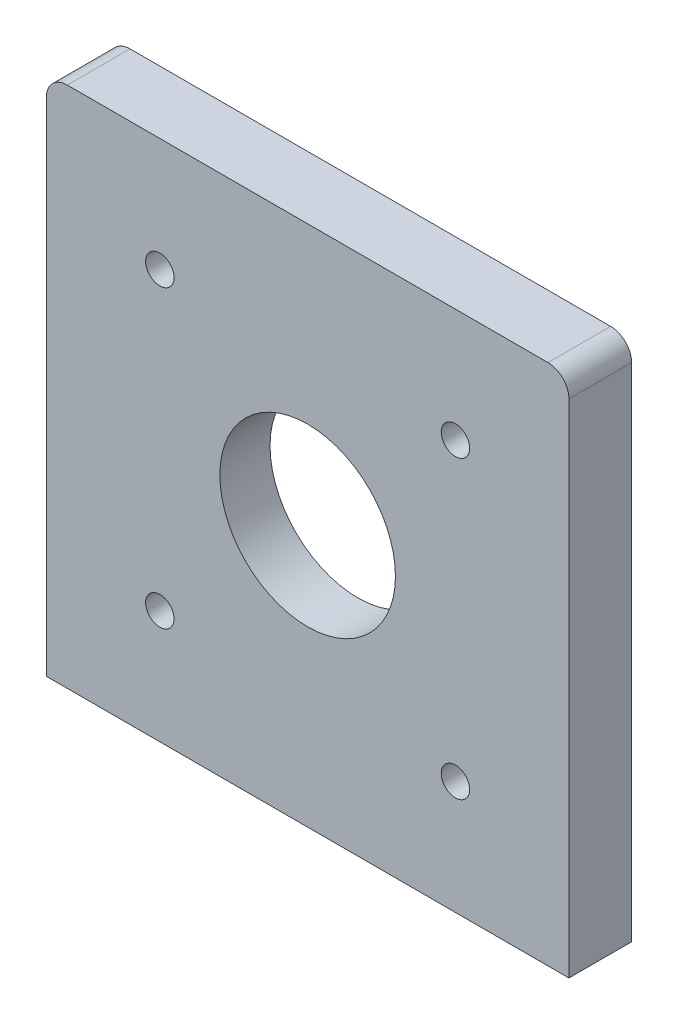
ISO-10303-21;
HEADER;
FILE_DESCRIPTION(('STEP AP214'),'2;1');
FILE_NAME('part.step','',(''),(''),'','','');
FILE_SCHEMA(('AUTOMOTIVE_DESIGN { 1 0 10303 214 1 1 1 1 }'));
ENDSEC;
DATA;
#1=APPLICATION_CONTEXT('core data for automotive mechanical design processes');
#2=APPLICATION_PROTOCOL_DEFINITION('international standard','automotive_design',2000,#1);
#3=PRODUCT_CONTEXT('',#1,'mechanical');
#4=PRODUCT('Part','Part','',(#3));
#5=PRODUCT_RELATED_PRODUCT_CATEGORY('part','',(#4));
#6=PRODUCT_DEFINITION_FORMATION('','',#4);
#7=PRODUCT_DEFINITION_CONTEXT('part definition',#1,'design');
#8=PRODUCT_DEFINITION('design','',#6,#7);
#9=PRODUCT_DEFINITION_SHAPE('','',#8);
#10=(LENGTH_UNIT() NAMED_UNIT(*) SI_UNIT(.MILLI.,.METRE.));
#11=(NAMED_UNIT(*) PLANE_ANGLE_UNIT() SI_UNIT($,.RADIAN.));
#12=(NAMED_UNIT(*) SI_UNIT($,.STERADIAN.) SOLID_ANGLE_UNIT());
#13=UNCERTAINTY_MEASURE_WITH_UNIT(LENGTH_MEASURE(1.E-05),#10,'distance_accuracy_value','');
#14=(GEOMETRIC_REPRESENTATION_CONTEXT(3) GLOBAL_UNCERTAINTY_ASSIGNED_CONTEXT((#13)) GLOBAL_UNIT_ASSIGNED_CONTEXT((#10,
#11,#12)) REPRESENTATION_CONTEXT('',''));
#15=CARTESIAN_POINT('',(0.,0.,0.));
#16=DIRECTION('',(0.,0.,1.));
#17=DIRECTION('',(1.,0.,0.));
#18=AXIS2_PLACEMENT_3D('',#15,#16,#17);
#19=CARTESIAN_POINT('',(0.,0.,15.));
#20=DIRECTION('',(-1.,0.,0.));
#21=DIRECTION('',(0.,-1.,0.));
#22=AXIS2_PLACEMENT_3D('',#19,#20,#21);
#23=PLANE('',#22);
#24=DIRECTION('',(0.,1.,0.));
#25=VECTOR('',#24,1.);
#26=CARTESIAN_POINT('',(0.,0.,0.));
#27=LINE('',#26,#25);
#28=CARTESIAN_POINT('',(0.,0.,0.));
#29=VERTEX_POINT('',#28);
#30=CARTESIAN_POINT('',(0.,120.,0.));
#31=VERTEX_POINT('',#30);
#32=EDGE_CURVE('E129',#29,#31,#27,.T.);
#33=ORIENTED_EDGE('',*,*,#32,.T.);
#34=DIRECTION('',(0.,0.,-1.));
#35=VECTOR('',#34,1.);
#36=CARTESIAN_POINT('',(0.,120.,15.));
#37=LINE('',#36,#35);
#38=CARTESIAN_POINT('',(0.,120.,15.));
#39=VERTEX_POINT('',#38);
#40=EDGE_CURVE('E13',#31,#39,#37,.F.);
#41=ORIENTED_EDGE('',*,*,#40,.T.);
#42=DIRECTION('',(0.,1.,0.));
#43=VECTOR('',#42,1.);
#44=CARTESIAN_POINT('',(0.,0.,15.));
#45=LINE('',#44,#43);
#46=CARTESIAN_POINT('',(0.,0.,15.));
#47=VERTEX_POINT('',#46);
#48=EDGE_CURVE('E136',#47,#39,#45,.T.);
#49=ORIENTED_EDGE('',*,*,#48,.F.);
#50=DIRECTION('',(0.,0.,-1.));
#51=VECTOR('',#50,1.);
#52=CARTESIAN_POINT('',(0.,0.,15.));
#53=LINE('',#52,#51);
#54=EDGE_CURVE('E121',#47,#29,#53,.T.);
#55=ORIENTED_EDGE('',*,*,#54,.T.);
#56=EDGE_LOOP('',(#33,#41,#49,#55));
#57=FACE_BOUND('',#56,.T.);
#58=ADVANCED_FACE('F47',(#57),#23,.F.);
#59=CARTESIAN_POINT('',(0.,125.,15.));
#60=DIRECTION('',(0.,-1.,0.));
#61=DIRECTION('',(1.,0.,0.));
#62=AXIS2_PLACEMENT_3D('',#59,#60,#61);
#63=PLANE('',#62);
#64=DIRECTION('',(-1.,0.,0.));
#65=VECTOR('',#64,1.);
#66=CARTESIAN_POINT('',(0.,125.,0.));
#67=LINE('',#66,#65);
#68=CARTESIAN_POINT('',(-5.,125.,0.));
#69=VERTEX_POINT('',#68);
#70=CARTESIAN_POINT('',(-120.,125.,0.));
#71=VERTEX_POINT('',#70);
#72=EDGE_CURVE('E131',#69,#71,#67,.T.);
#73=ORIENTED_EDGE('',*,*,#72,.T.);
#74=DIRECTION('',(0.,0.,-1.));
#75=VECTOR('',#74,1.);
#76=CARTESIAN_POINT('',(-120.,125.,15.));
#77=LINE('',#76,#75);
#78=CARTESIAN_POINT('',(-120.,125.,15.));
#79=VERTEX_POINT('',#78);
#80=EDGE_CURVE('E68',#71,#79,#77,.F.);
#81=ORIENTED_EDGE('',*,*,#80,.T.);
#82=DIRECTION('',(-1.,0.,0.));
#83=VECTOR('',#82,1.);
#84=CARTESIAN_POINT('',(0.,125.,15.));
#85=LINE('',#84,#83);
#86=CARTESIAN_POINT('',(-5.,125.,15.));
#87=VERTEX_POINT('',#86);
#88=EDGE_CURVE('E111',#87,#79,#85,.T.);
#89=ORIENTED_EDGE('',*,*,#88,.F.);
#90=DIRECTION('',(0.,0.,-1.));
#91=VECTOR('',#90,1.);
#92=CARTESIAN_POINT('',(-5.,125.,15.));
#93=LINE('',#92,#91);
#94=EDGE_CURVE('E143',#87,#69,#93,.T.);
#95=ORIENTED_EDGE('',*,*,#94,.T.);
#96=EDGE_LOOP('',(#73,#81,#89,#95));
#97=FACE_BOUND('',#96,.T.);
#98=ADVANCED_FACE('F151',(#97),#63,.F.);
#99=CARTESIAN_POINT('',(-125.,0.,15.));
#100=DIRECTION('',(1.,0.,0.));
#101=DIRECTION('',(0.,1.,0.));
#102=AXIS2_PLACEMENT_3D('',#99,#100,#101);
#103=PLANE('',#102);
#104=DIRECTION('',(0.,-1.,0.));
#105=VECTOR('',#104,1.);
#106=CARTESIAN_POINT('',(-125.,0.,15.));
#107=LINE('',#106,#105);
#108=CARTESIAN_POINT('',(-125.,120.,15.));
#109=VERTEX_POINT('',#108);
#110=CARTESIAN_POINT('',(-125.,0.,15.));
#111=VERTEX_POINT('',#110);
#112=EDGE_CURVE('E101',#109,#111,#107,.T.);
#113=ORIENTED_EDGE('',*,*,#112,.F.);
#114=DIRECTION('',(0.,0.,-1.));
#115=VECTOR('',#114,1.);
#116=CARTESIAN_POINT('',(-125.,120.,15.));
#117=LINE('',#116,#115);
#118=CARTESIAN_POINT('',(-125.,120.,0.));
#119=VERTEX_POINT('',#118);
#120=EDGE_CURVE('E120',#109,#119,#117,.T.);
#121=ORIENTED_EDGE('',*,*,#120,.T.);
#122=DIRECTION('',(0.,-1.,0.));
#123=VECTOR('',#122,1.);
#124=CARTESIAN_POINT('',(-125.,0.,0.));
#125=LINE('',#124,#123);
#126=CARTESIAN_POINT('',(-125.,0.,0.));
#127=VERTEX_POINT('',#126);
#128=EDGE_CURVE('E117',#119,#127,#125,.T.);
#129=ORIENTED_EDGE('',*,*,#128,.T.);
#130=DIRECTION('',(0.,0.,-1.));
#131=VECTOR('',#130,1.);
#132=CARTESIAN_POINT('',(-125.,0.,15.));
#133=LINE('',#132,#131);
#134=EDGE_CURVE('E114',#111,#127,#133,.T.);
#135=ORIENTED_EDGE('',*,*,#134,.F.);
#136=EDGE_LOOP('',(#113,#121,#129,#135));
#137=FACE_BOUND('',#136,.T.);
#138=ADVANCED_FACE('F115',(#137),#103,.F.);
#139=CARTESIAN_POINT('',(0.,0.,15.));
#140=DIRECTION('',(0.,1.,0.));
#141=DIRECTION('',(-1.,0.,0.));
#142=AXIS2_PLACEMENT_3D('',#139,#140,#141);
#143=PLANE('',#142);
#144=DIRECTION('',(1.,0.,0.));
#145=VECTOR('',#144,1.);
#146=CARTESIAN_POINT('',(0.,0.,0.));
#147=LINE('',#146,#145);
#148=EDGE_CURVE('E135',#127,#29,#147,.T.);
#149=ORIENTED_EDGE('',*,*,#148,.T.);
#150=ORIENTED_EDGE('',*,*,#54,.F.);
#151=DIRECTION('',(1.,0.,0.));
#152=VECTOR('',#151,1.);
#153=CARTESIAN_POINT('',(0.,0.,15.));
#154=LINE('',#153,#152);
#155=EDGE_CURVE('E105',#111,#47,#154,.T.);
#156=ORIENTED_EDGE('',*,*,#155,.F.);
#157=ORIENTED_EDGE('',*,*,#134,.T.);
#158=EDGE_LOOP('',(#149,#150,#156,#157));
#159=FACE_BOUND('',#158,.T.);
#160=ADVANCED_FACE('F123',(#159),#143,.F.);
#161=CARTESIAN_POINT('',(0.,0.,15.));
#162=DIRECTION('',(0.,0.,1.));
#163=DIRECTION('',(1.,0.,0.));
#164=AXIS2_PLACEMENT_3D('',#161,#162,#163);
#165=PLANE('',#164);
#166=CARTESIAN_POINT('',(-97.8553390593274,97.8553390593275,15.));
#167=DIRECTION('',(0.,0.,1.));
#168=DIRECTION('',(1.,0.,0.));
#169=AXIS2_PLACEMENT_3D('',#166,#167,#168);
#170=CIRCLE('',#169,3.39999999999999);
#171=CARTESIAN_POINT('',(-94.4553390593274,97.8553390593275,15.));
#172=VERTEX_POINT('',#171);
#173=EDGE_CURVE('E187',#172,#172,#170,.T.);
#174=ORIENTED_EDGE('',*,*,#173,.F.);
#175=EDGE_LOOP('',(#174));
#176=FACE_BOUND('',#175,.T.);
#177=CARTESIAN_POINT('',(-27.1446609406726,97.8553390593275,15.));
#178=DIRECTION('',(0.,0.,1.));
#179=DIRECTION('',(1.,0.,0.));
#180=AXIS2_PLACEMENT_3D('',#177,#178,#179);
#181=CIRCLE('',#180,3.39999999999999);
#182=CARTESIAN_POINT('',(-23.7446609406726,97.8553390593275,15.));
#183=VERTEX_POINT('',#182);
#184=EDGE_CURVE('E181',#183,#183,#181,.T.);
#185=ORIENTED_EDGE('',*,*,#184,.F.);
#186=EDGE_LOOP('',(#185));
#187=FACE_BOUND('',#186,.T.);
#188=CARTESIAN_POINT('',(-27.1446609406726,27.1446609406727,15.));
#189=DIRECTION('',(0.,0.,1.));
#190=DIRECTION('',(1.,0.,0.));
#191=AXIS2_PLACEMENT_3D('',#188,#189,#190);
#192=CIRCLE('',#191,3.39999999999999);
#193=CARTESIAN_POINT('',(-23.7446609406726,27.1446609406727,15.));
#194=VERTEX_POINT('',#193);
#195=EDGE_CURVE('E175',#194,#194,#192,.T.);
#196=ORIENTED_EDGE('',*,*,#195,.F.);
#197=EDGE_LOOP('',(#196));
#198=FACE_BOUND('',#197,.T.);
#199=CARTESIAN_POINT('',(-97.8553390593274,27.1446609406727,15.));
#200=DIRECTION('',(0.,0.,1.));
#201=DIRECTION('',(1.,0.,0.));
#202=AXIS2_PLACEMENT_3D('',#199,#200,#201);
#203=CIRCLE('',#202,3.39999999999999);
#204=CARTESIAN_POINT('',(-94.4553390593274,27.1446609406727,15.));
#205=VERTEX_POINT('',#204);
#206=EDGE_CURVE('E169',#205,#205,#203,.T.);
#207=ORIENTED_EDGE('',*,*,#206,.F.);
#208=EDGE_LOOP('',(#207));
#209=FACE_BOUND('',#208,.T.);
#210=CARTESIAN_POINT('',(-62.5,62.5,15.));
#211=DIRECTION('',(0.,0.,1.));
#212=DIRECTION('',(1.,0.,0.));
#213=AXIS2_PLACEMENT_3D('',#210,#211,#212);
#214=CIRCLE('',#213,21.);
#215=CARTESIAN_POINT('',(-41.5,62.5,15.));
#216=VERTEX_POINT('',#215);
#217=EDGE_CURVE('E161',#216,#216,#214,.T.);
#218=ORIENTED_EDGE('',*,*,#217,.F.);
#219=EDGE_LOOP('',(#218));
#220=FACE_BOUND('',#219,.T.);
#221=ORIENTED_EDGE('',*,*,#88,.T.);
#222=CARTESIAN_POINT('',(-120.,120.,15.));
#223=DIRECTION('',(0.,0.,1.));
#224=DIRECTION('',(1.,0.,0.));
#225=AXIS2_PLACEMENT_3D('',#222,#223,#224);
#226=CIRCLE('',#225,5.);
#227=EDGE_CURVE('E55',#79,#109,#226,.T.);
#228=ORIENTED_EDGE('',*,*,#227,.T.);
#229=ORIENTED_EDGE('',*,*,#112,.T.);
#230=ORIENTED_EDGE('',*,*,#155,.T.);
#231=ORIENTED_EDGE('',*,*,#48,.T.);
#232=CARTESIAN_POINT('',(-5.,120.,15.));
#233=DIRECTION('',(0.,0.,1.));
#234=DIRECTION('',(1.,0.,0.));
#235=AXIS2_PLACEMENT_3D('',#232,#233,#234);
#236=CIRCLE('',#235,5.);
#237=EDGE_CURVE('E147',#39,#87,#236,.T.);
#238=ORIENTED_EDGE('',*,*,#237,.T.);
#239=EDGE_LOOP('',(#221,#228,#229,#230,#231,#238));
#240=FACE_BOUND('',#239,.T.);
#241=ADVANCED_FACE('F103',(#176,#187,#198,#209,#220,#240),#165,.T.);
#242=CARTESIAN_POINT('',(0.,0.,0.));
#243=DIRECTION('',(0.,0.,1.));
#244=DIRECTION('',(1.,0.,0.));
#245=AXIS2_PLACEMENT_3D('',#242,#243,#244);
#246=PLANE('',#245);
#247=CARTESIAN_POINT('',(-97.8553390593274,97.8553390593275,0.));
#248=DIRECTION('',(0.,0.,-1.));
#249=DIRECTION('',(-1.,0.,0.));
#250=AXIS2_PLACEMENT_3D('',#247,#248,#249);
#251=CIRCLE('',#250,3.39999999999999);
#252=CARTESIAN_POINT('',(-101.255339059327,97.8553390593275,0.));
#253=VERTEX_POINT('',#252);
#254=EDGE_CURVE('E190',#253,#253,#251,.T.);
#255=ORIENTED_EDGE('',*,*,#254,.F.);
#256=EDGE_LOOP('',(#255));
#257=FACE_BOUND('',#256,.T.);
#258=CARTESIAN_POINT('',(-27.1446609406726,97.8553390593275,0.));
#259=DIRECTION('',(0.,0.,-1.));
#260=DIRECTION('',(-1.,0.,0.));
#261=AXIS2_PLACEMENT_3D('',#258,#259,#260);
#262=CIRCLE('',#261,3.39999999999999);
#263=CARTESIAN_POINT('',(-30.5446609406726,97.8553390593275,0.));
#264=VERTEX_POINT('',#263);
#265=EDGE_CURVE('E184',#264,#264,#262,.T.);
#266=ORIENTED_EDGE('',*,*,#265,.F.);
#267=EDGE_LOOP('',(#266));
#268=FACE_BOUND('',#267,.T.);
#269=CARTESIAN_POINT('',(-27.1446609406726,27.1446609406727,0.));
#270=DIRECTION('',(0.,0.,-1.));
#271=DIRECTION('',(-1.,0.,0.));
#272=AXIS2_PLACEMENT_3D('',#269,#270,#271);
#273=CIRCLE('',#272,3.39999999999999);
#274=CARTESIAN_POINT('',(-30.5446609406726,27.1446609406727,0.));
#275=VERTEX_POINT('',#274);
#276=EDGE_CURVE('E178',#275,#275,#273,.T.);
#277=ORIENTED_EDGE('',*,*,#276,.F.);
#278=EDGE_LOOP('',(#277));
#279=FACE_BOUND('',#278,.T.);
#280=CARTESIAN_POINT('',(-97.8553390593274,27.1446609406727,0.));
#281=DIRECTION('',(0.,0.,-1.));
#282=DIRECTION('',(-1.,0.,0.));
#283=AXIS2_PLACEMENT_3D('',#280,#281,#282);
#284=CIRCLE('',#283,3.39999999999999);
#285=CARTESIAN_POINT('',(-101.255339059327,27.1446609406727,0.));
#286=VERTEX_POINT('',#285);
#287=EDGE_CURVE('E172',#286,#286,#284,.T.);
#288=ORIENTED_EDGE('',*,*,#287,.F.);
#289=EDGE_LOOP('',(#288));
#290=FACE_BOUND('',#289,.T.);
#291=CARTESIAN_POINT('',(-62.5,62.5,0.));
#292=DIRECTION('',(0.,0.,-1.));
#293=DIRECTION('',(-1.,0.,0.));
#294=AXIS2_PLACEMENT_3D('',#291,#292,#293);
#295=CIRCLE('',#294,40.);
#296=CARTESIAN_POINT('',(-102.5,62.5,0.));
#297=VERTEX_POINT('',#296);
#298=EDGE_CURVE('E158',#297,#297,#295,.T.);
#299=ORIENTED_EDGE('',*,*,#298,.F.);
#300=EDGE_LOOP('',(#299));
#301=FACE_BOUND('',#300,.T.);
#302=ORIENTED_EDGE('',*,*,#128,.F.);
#303=CARTESIAN_POINT('',(-120.,120.,0.));
#304=DIRECTION('',(0.,0.,1.));
#305=DIRECTION('',(1.,0.,0.));
#306=AXIS2_PLACEMENT_3D('',#303,#304,#305);
#307=CIRCLE('',#306,5.);
#308=EDGE_CURVE('E141',#119,#71,#307,.F.);
#309=ORIENTED_EDGE('',*,*,#308,.T.);
#310=ORIENTED_EDGE('',*,*,#72,.F.);
#311=CARTESIAN_POINT('',(-5.,120.,0.));
#312=DIRECTION('',(0.,0.,1.));
#313=DIRECTION('',(1.,0.,0.));
#314=AXIS2_PLACEMENT_3D('',#311,#312,#313);
#315=CIRCLE('',#314,5.);
#316=EDGE_CURVE('E139',#69,#31,#315,.F.);
#317=ORIENTED_EDGE('',*,*,#316,.T.);
#318=ORIENTED_EDGE('',*,*,#32,.F.);
#319=ORIENTED_EDGE('',*,*,#148,.F.);
#320=EDGE_LOOP('',(#302,#309,#310,#317,#318,#319));
#321=FACE_BOUND('',#320,.T.);
#322=ADVANCED_FACE('F155',(#257,#268,#279,#290,#301,#321),#246,.F.);
#323=CARTESIAN_POINT('',(-62.5,62.5,3.));
#324=DIRECTION('',(0.,0.,-1.));
#325=DIRECTION('',(-1.,0.,0.));
#326=AXIS2_PLACEMENT_3D('',#323,#324,#325);
#327=CYLINDRICAL_SURFACE('',#326,40.);
#328=CARTESIAN_POINT('',(-62.5,62.5,3.));
#329=DIRECTION('',(0.,0.,-1.));
#330=DIRECTION('',(-1.,0.,0.));
#331=AXIS2_PLACEMENT_3D('',#328,#329,#330);
#332=CIRCLE('',#331,40.);
#333=CARTESIAN_POINT('',(-102.5,62.5,3.));
#334=VERTEX_POINT('',#333);
#335=EDGE_CURVE('E132',#334,#334,#332,.T.);
#336=ORIENTED_EDGE('',*,*,#335,.F.);
#337=EDGE_LOOP('',(#336));
#338=FACE_BOUND('',#337,.T.);
#339=ORIENTED_EDGE('',*,*,#298,.T.);
#340=EDGE_LOOP('',(#339));
#341=FACE_BOUND('',#340,.T.);
#342=ADVANCED_FACE('F198',(#338,#341),#327,.F.);
#343=CARTESIAN_POINT('',(-62.5,62.5,3.));
#344=DIRECTION('',(0.,0.,-1.));
#345=DIRECTION('',(-1.,0.,0.));
#346=AXIS2_PLACEMENT_3D('',#343,#344,#345);
#347=PLANE('',#346);
#348=CARTESIAN_POINT('',(-62.5,62.5,3.));
#349=DIRECTION('',(0.,0.,-1.));
#350=DIRECTION('',(-1.,0.,0.));
#351=AXIS2_PLACEMENT_3D('',#348,#349,#350);
#352=CIRCLE('',#351,21.);
#353=CARTESIAN_POINT('',(-83.5,62.5,3.));
#354=VERTEX_POINT('',#353);
#355=EDGE_CURVE('E166',#354,#354,#352,.T.);
#356=ORIENTED_EDGE('',*,*,#355,.F.);
#357=EDGE_LOOP('',(#356));
#358=FACE_BOUND('',#357,.T.);
#359=ORIENTED_EDGE('',*,*,#335,.T.);
#360=EDGE_LOOP('',(#359));
#361=FACE_BOUND('',#360,.T.);
#362=ADVANCED_FACE('F209',(#358,#361),#347,.T.);
#363=CARTESIAN_POINT('',(-120.,120.,15.));
#364=DIRECTION('',(0.,0.,-1.));
#365=DIRECTION('',(-1.,0.,0.));
#366=AXIS2_PLACEMENT_3D('',#363,#364,#365);
#367=CYLINDRICAL_SURFACE('',#366,5.);
#368=ORIENTED_EDGE('',*,*,#227,.F.);
#369=ORIENTED_EDGE('',*,*,#80,.F.);
#370=ORIENTED_EDGE('',*,*,#308,.F.);
#371=ORIENTED_EDGE('',*,*,#120,.F.);
#372=EDGE_LOOP('',(#368,#369,#370,#371));
#373=FACE_BOUND('',#372,.T.);
#374=ADVANCED_FACE('F215',(#373),#367,.T.);
#375=CARTESIAN_POINT('',(-5.,120.,15.));
#376=DIRECTION('',(0.,0.,-1.));
#377=DIRECTION('',(-1.,0.,0.));
#378=AXIS2_PLACEMENT_3D('',#375,#376,#377);
#379=CYLINDRICAL_SURFACE('',#378,5.);
#380=ORIENTED_EDGE('',*,*,#237,.F.);
#381=ORIENTED_EDGE('',*,*,#40,.F.);
#382=ORIENTED_EDGE('',*,*,#316,.F.);
#383=ORIENTED_EDGE('',*,*,#94,.F.);
#384=EDGE_LOOP('',(#380,#381,#382,#383));
#385=FACE_BOUND('',#384,.T.);
#386=ADVANCED_FACE('F49',(#385),#379,.T.);
#387=CARTESIAN_POINT('',(-62.5,62.5,18.));
#388=DIRECTION('',(0.,0.,-1.));
#389=DIRECTION('',(-1.,0.,0.));
#390=AXIS2_PLACEMENT_3D('',#387,#388,#389);
#391=CYLINDRICAL_SURFACE('',#390,21.);
#392=ORIENTED_EDGE('',*,*,#217,.T.);
#393=EDGE_LOOP('',(#392));
#394=FACE_BOUND('',#393,.T.);
#395=ORIENTED_EDGE('',*,*,#355,.T.);
#396=EDGE_LOOP('',(#395));
#397=FACE_BOUND('',#396,.T.);
#398=ADVANCED_FACE('F232',(#394,#397),#391,.F.);
#399=CARTESIAN_POINT('',(-97.8553390593274,27.1446609406727,0.));
#400=DIRECTION('',(0.,0.,-1.));
#401=DIRECTION('',(-1.,0.,0.));
#402=AXIS2_PLACEMENT_3D('',#399,#400,#401);
#403=CYLINDRICAL_SURFACE('',#402,3.39999999999999);
#404=ORIENTED_EDGE('',*,*,#206,.T.);
#405=EDGE_LOOP('',(#404));
#406=FACE_BOUND('',#405,.T.);
#407=ORIENTED_EDGE('',*,*,#287,.T.);
#408=EDGE_LOOP('',(#407));
#409=FACE_BOUND('',#408,.T.);
#410=ADVANCED_FACE('F236',(#406,#409),#403,.F.);
#411=CARTESIAN_POINT('',(-27.1446609406726,27.1446609406727,0.));
#412=DIRECTION('',(0.,0.,-1.));
#413=DIRECTION('',(-1.,0.,0.));
#414=AXIS2_PLACEMENT_3D('',#411,#412,#413);
#415=CYLINDRICAL_SURFACE('',#414,3.39999999999999);
#416=ORIENTED_EDGE('',*,*,#195,.T.);
#417=EDGE_LOOP('',(#416));
#418=FACE_BOUND('',#417,.T.);
#419=ORIENTED_EDGE('',*,*,#276,.T.);
#420=EDGE_LOOP('',(#419));
#421=FACE_BOUND('',#420,.T.);
#422=ADVANCED_FACE('F242',(#418,#421),#415,.F.);
#423=CARTESIAN_POINT('',(-27.1446609406726,97.8553390593275,0.));
#424=DIRECTION('',(0.,0.,-1.));
#425=DIRECTION('',(-1.,0.,0.));
#426=AXIS2_PLACEMENT_3D('',#423,#424,#425);
#427=CYLINDRICAL_SURFACE('',#426,3.39999999999999);
#428=ORIENTED_EDGE('',*,*,#184,.T.);
#429=EDGE_LOOP('',(#428));
#430=FACE_BOUND('',#429,.T.);
#431=ORIENTED_EDGE('',*,*,#265,.T.);
#432=EDGE_LOOP('',(#431));
#433=FACE_BOUND('',#432,.T.);
#434=ADVANCED_FACE('F249',(#430,#433),#427,.F.);
#435=CARTESIAN_POINT('',(-97.8553390593274,97.8553390593275,0.));
#436=DIRECTION('',(0.,0.,-1.));
#437=DIRECTION('',(-1.,0.,0.));
#438=AXIS2_PLACEMENT_3D('',#435,#436,#437);
#439=CYLINDRICAL_SURFACE('',#438,3.39999999999999);
#440=ORIENTED_EDGE('',*,*,#173,.T.);
#441=EDGE_LOOP('',(#440));
#442=FACE_BOUND('',#441,.T.);
#443=ORIENTED_EDGE('',*,*,#254,.T.);
#444=EDGE_LOOP('',(#443));
#445=FACE_BOUND('',#444,.T.);
#446=ADVANCED_FACE('F194',(#442,#445),#439,.F.);
#447=CLOSED_SHELL('',(#58,#98,#138,#160,#241,#322,#342,#362,#374,#386,#398,#410,#422,#434,#446));
#448=MANIFOLD_SOLID_BREP('B2',#447);
#449=ADVANCED_BREP_SHAPE_REPRESENTATION('',(#18,#448),#14);
#450=SHAPE_DEFINITION_REPRESENTATION(#9,#449);
ENDSEC;
END-ISO-10303-21;
